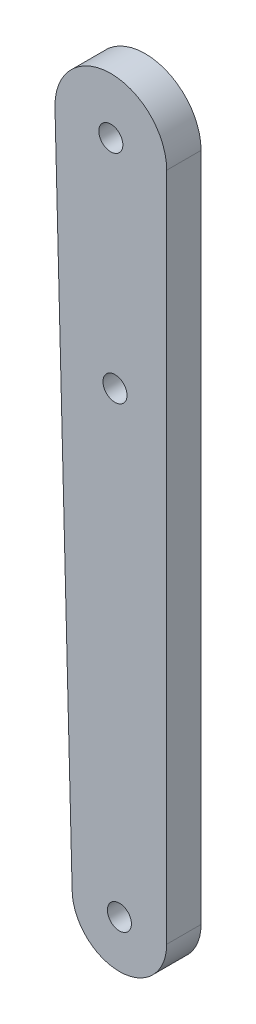
ISO-10303-21;
HEADER;
FILE_DESCRIPTION(('STEP AP214'),'2;1');
FILE_NAME('part.step','',(''),(''),'','','');
FILE_SCHEMA(('AUTOMOTIVE_DESIGN { 1 0 10303 214 1 1 1 1 }'));
ENDSEC;
DATA;
#1=APPLICATION_CONTEXT('core data for automotive mechanical design processes');
#2=APPLICATION_PROTOCOL_DEFINITION('international standard','automotive_design',2000,#1);
#3=PRODUCT_CONTEXT('',#1,'mechanical');
#4=PRODUCT('Part','Part','',(#3));
#5=PRODUCT_RELATED_PRODUCT_CATEGORY('part','',(#4));
#6=PRODUCT_DEFINITION_FORMATION('','',#4);
#7=PRODUCT_DEFINITION_CONTEXT('part definition',#1,'design');
#8=PRODUCT_DEFINITION('design','',#6,#7);
#9=PRODUCT_DEFINITION_SHAPE('','',#8);
#10=(LENGTH_UNIT() NAMED_UNIT(*) SI_UNIT(.MILLI.,.METRE.));
#11=(NAMED_UNIT(*) PLANE_ANGLE_UNIT() SI_UNIT($,.RADIAN.));
#12=(NAMED_UNIT(*) SI_UNIT($,.STERADIAN.) SOLID_ANGLE_UNIT());
#13=UNCERTAINTY_MEASURE_WITH_UNIT(LENGTH_MEASURE(1.E-05),#10,'distance_accuracy_value','');
#14=(GEOMETRIC_REPRESENTATION_CONTEXT(3) GLOBAL_UNCERTAINTY_ASSIGNED_CONTEXT((#13)) GLOBAL_UNIT_ASSIGNED_CONTEXT((#10,
#11,#12)) REPRESENTATION_CONTEXT('',''));
#15=CARTESIAN_POINT('',(0.,0.,0.));
#16=DIRECTION('',(0.,0.,1.));
#17=DIRECTION('',(1.,0.,0.));
#18=AXIS2_PLACEMENT_3D('',#15,#16,#17);
#19=CARTESIAN_POINT('',(-5.50068845938089,-12.9839082792742,4.));
#20=DIRECTION('',(0.,0.,1.));
#21=DIRECTION('',(1.,0.,0.));
#22=AXIS2_PLACEMENT_3D('',#19,#20,#21);
#23=PLANE('',#22);
#24=CARTESIAN_POINT('',(-5.50068845938089,-12.9839082792742,4.));
#25=DIRECTION('',(0.,0.,1.));
#26=DIRECTION('',(1.,0.,0.));
#27=AXIS2_PLACEMENT_3D('',#24,#25,#26);
#28=CIRCLE('',#27,1.4);
#29=CARTESIAN_POINT('',(-4.10068845938089,-12.9839082792742,4.));
#30=VERTEX_POINT('',#29);
#31=EDGE_CURVE('E118',#30,#30,#28,.T.);
#32=ORIENTED_EDGE('',*,*,#31,.F.);
#33=EDGE_LOOP('',(#32));
#34=FACE_BOUND('',#33,.T.);
#35=CARTESIAN_POINT('',(-5.50068845938089,-12.9839082792742,4.));
#36=DIRECTION('',(0.,0.,1.));
#37=DIRECTION('',(1.,0.,0.));
#38=AXIS2_PLACEMENT_3D('',#35,#36,#37);
#39=CIRCLE('',#38,5.5);
#40=CARTESIAN_POINT('',(-11.0006884593809,-12.9839082792742,4.));
#41=VERTEX_POINT('',#40);
#42=CARTESIAN_POINT('',(-0.000688459380887053,-12.9839082792742,4.));
#43=VERTEX_POINT('',#42);
#44=EDGE_CURVE('E88',#41,#43,#39,.T.);
#45=ORIENTED_EDGE('',*,*,#44,.T.);
#46=DIRECTION('',(0.,1.,0.));
#47=VECTOR('',#46,1.);
#48=CARTESIAN_POINT('',(-0.000688459380887053,-12.9839082792742,4.));
#49=LINE('',#48,#47);
#50=CARTESIAN_POINT('',(-0.000688459380887053,65.0160917207258,4.));
#51=VERTEX_POINT('',#50);
#52=EDGE_CURVE('E83',#43,#51,#49,.T.);
#53=ORIENTED_EDGE('',*,*,#52,.T.);
#54=CARTESIAN_POINT('',(-6.50068845938089,65.0160917207258,4.));
#55=DIRECTION('',(0.,0.,1.));
#56=DIRECTION('',(1.,0.,0.));
#57=AXIS2_PLACEMENT_3D('',#54,#55,#56);
#58=CIRCLE('',#57,6.5);
#59=CARTESIAN_POINT('',(-13.0006884593809,65.0160917207258,4.));
#60=VERTEX_POINT('',#59);
#61=EDGE_CURVE('E86',#51,#60,#58,.T.);
#62=ORIENTED_EDGE('',*,*,#61,.T.);
#63=DIRECTION('',(0.0256326007925508,-0.999671430909481,0.));
#64=VECTOR('',#63,1.);
#65=CARTESIAN_POINT('',(-13.0006884593809,65.0160917207258,4.));
#66=LINE('',#65,#64);
#67=EDGE_CURVE('E53',#60,#41,#66,.T.);
#68=ORIENTED_EDGE('',*,*,#67,.T.);
#69=EDGE_LOOP('',(#45,#53,#62,#68));
#70=FACE_BOUND('',#69,.T.);
#71=CARTESIAN_POINT('',(-6.50068845938089,65.0160917207258,4.));
#72=DIRECTION('',(0.,0.,1.));
#73=DIRECTION('',(1.,0.,0.));
#74=AXIS2_PLACEMENT_3D('',#71,#72,#73);
#75=CIRCLE('',#74,1.4);
#76=CARTESIAN_POINT('',(-5.10068845938089,65.0160917207258,4.));
#77=VERTEX_POINT('',#76);
#78=EDGE_CURVE('E103',#77,#77,#75,.T.);
#79=ORIENTED_EDGE('',*,*,#78,.F.);
#80=EDGE_LOOP('',(#79));
#81=FACE_BOUND('',#80,.T.);
#82=CARTESIAN_POINT('',(-6.01275635098238,40.0160917207258,4.));
#83=DIRECTION('',(0.,0.,1.));
#84=DIRECTION('',(1.,0.,0.));
#85=AXIS2_PLACEMENT_3D('',#82,#83,#84);
#86=CIRCLE('',#85,1.4);
#87=CARTESIAN_POINT('',(-4.61275635098238,40.0160917207258,4.));
#88=VERTEX_POINT('',#87);
#89=EDGE_CURVE('E124',#88,#88,#86,.T.);
#90=ORIENTED_EDGE('',*,*,#89,.F.);
#91=EDGE_LOOP('',(#90));
#92=FACE_BOUND('',#91,.T.);
#93=ADVANCED_FACE('F36',(#34,#70,#81,#92),#23,.T.);
#94=CARTESIAN_POINT('',(-5.50068845938089,-12.9839082792742,0.));
#95=DIRECTION('',(0.,0.,1.));
#96=DIRECTION('',(1.,0.,0.));
#97=AXIS2_PLACEMENT_3D('',#94,#95,#96);
#98=PLANE('',#97);
#99=CARTESIAN_POINT('',(-5.50068845938089,-12.9839082792742,0.));
#100=DIRECTION('',(0.,0.,1.));
#101=DIRECTION('',(1.,0.,0.));
#102=AXIS2_PLACEMENT_3D('',#99,#100,#101);
#103=CIRCLE('',#102,5.5);
#104=CARTESIAN_POINT('',(-11.0006884593809,-12.9839082792742,0.));
#105=VERTEX_POINT('',#104);
#106=CARTESIAN_POINT('',(-0.000688459380887053,-12.9839082792742,0.));
#107=VERTEX_POINT('',#106);
#108=EDGE_CURVE('E100',#105,#107,#103,.T.);
#109=ORIENTED_EDGE('',*,*,#108,.F.);
#110=DIRECTION('',(0.0256326007925508,-0.999671430909481,0.));
#111=VECTOR('',#110,1.);
#112=CARTESIAN_POINT('',(-13.0006884593809,65.0160917207258,0.));
#113=LINE('',#112,#111);
#114=CARTESIAN_POINT('',(-13.0006884593809,65.0160917207258,0.));
#115=VERTEX_POINT('',#114);
#116=EDGE_CURVE('E76',#115,#105,#113,.T.);
#117=ORIENTED_EDGE('',*,*,#116,.F.);
#118=CARTESIAN_POINT('',(-6.50068845938089,65.0160917207258,0.));
#119=DIRECTION('',(0.,0.,1.));
#120=DIRECTION('',(1.,0.,0.));
#121=AXIS2_PLACEMENT_3D('',#118,#119,#120);
#122=CIRCLE('',#121,6.5);
#123=CARTESIAN_POINT('',(-0.000688459380887053,65.0160917207258,0.));
#124=VERTEX_POINT('',#123);
#125=EDGE_CURVE('E70',#124,#115,#122,.T.);
#126=ORIENTED_EDGE('',*,*,#125,.F.);
#127=DIRECTION('',(0.,1.,0.));
#128=VECTOR('',#127,1.);
#129=CARTESIAN_POINT('',(-0.000688459380887053,-12.9839082792742,0.));
#130=LINE('',#129,#128);
#131=EDGE_CURVE('E92',#107,#124,#130,.T.);
#132=ORIENTED_EDGE('',*,*,#131,.F.);
#133=EDGE_LOOP('',(#109,#117,#126,#132));
#134=FACE_BOUND('',#133,.T.);
#135=CARTESIAN_POINT('',(-6.50068845938089,65.0160917207258,0.));
#136=DIRECTION('',(0.,0.,1.));
#137=DIRECTION('',(1.,0.,0.));
#138=AXIS2_PLACEMENT_3D('',#135,#136,#137);
#139=CIRCLE('',#138,1.4);
#140=CARTESIAN_POINT('',(-5.10068845938089,65.0160917207258,0.));
#141=VERTEX_POINT('',#140);
#142=EDGE_CURVE('E115',#141,#141,#139,.T.);
#143=ORIENTED_EDGE('',*,*,#142,.T.);
#144=EDGE_LOOP('',(#143));
#145=FACE_BOUND('',#144,.T.);
#146=CARTESIAN_POINT('',(-5.50068845938089,-12.9839082792742,0.));
#147=DIRECTION('',(0.,0.,1.));
#148=DIRECTION('',(1.,0.,0.));
#149=AXIS2_PLACEMENT_3D('',#146,#147,#148);
#150=CIRCLE('',#149,1.4);
#151=CARTESIAN_POINT('',(-4.10068845938089,-12.9839082792742,0.));
#152=VERTEX_POINT('',#151);
#153=EDGE_CURVE('E121',#152,#152,#150,.T.);
#154=ORIENTED_EDGE('',*,*,#153,.T.);
#155=EDGE_LOOP('',(#154));
#156=FACE_BOUND('',#155,.T.);
#157=CARTESIAN_POINT('',(-6.01275635098238,40.0160917207258,0.));
#158=DIRECTION('',(0.,0.,1.));
#159=DIRECTION('',(1.,0.,0.));
#160=AXIS2_PLACEMENT_3D('',#157,#158,#159);
#161=CIRCLE('',#160,1.4);
#162=CARTESIAN_POINT('',(-4.61275635098238,40.0160917207258,0.));
#163=VERTEX_POINT('',#162);
#164=EDGE_CURVE('E127',#163,#163,#161,.T.);
#165=ORIENTED_EDGE('',*,*,#164,.T.);
#166=EDGE_LOOP('',(#165));
#167=FACE_BOUND('',#166,.T.);
#168=ADVANCED_FACE('F111',(#134,#145,#156,#167),#98,.F.);
#169=CARTESIAN_POINT('',(-5.50068845938089,-12.9839082792742,4.));
#170=DIRECTION('',(0.,0.,-1.));
#171=DIRECTION('',(-1.,0.,0.));
#172=AXIS2_PLACEMENT_3D('',#169,#170,#171);
#173=CYLINDRICAL_SURFACE('',#172,5.5);
#174=ORIENTED_EDGE('',*,*,#108,.T.);
#175=DIRECTION('',(0.,0.,-1.));
#176=VECTOR('',#175,1.);
#177=CARTESIAN_POINT('',(-0.000688459380887053,-12.9839082792742,4.));
#178=LINE('',#177,#176);
#179=EDGE_CURVE('E11',#43,#107,#178,.T.);
#180=ORIENTED_EDGE('',*,*,#179,.F.);
#181=ORIENTED_EDGE('',*,*,#44,.F.);
#182=DIRECTION('',(0.,0.,-1.));
#183=VECTOR('',#182,1.);
#184=CARTESIAN_POINT('',(-11.0006884593809,-12.9839082792742,4.));
#185=LINE('',#184,#183);
#186=EDGE_CURVE('E96',#41,#105,#185,.T.);
#187=ORIENTED_EDGE('',*,*,#186,.T.);
#188=EDGE_LOOP('',(#174,#180,#181,#187));
#189=FACE_BOUND('',#188,.T.);
#190=ADVANCED_FACE('F38',(#189),#173,.T.);
#191=CARTESIAN_POINT('',(-0.000688459380887053,-12.9839082792742,4.));
#192=DIRECTION('',(-1.,0.,0.));
#193=DIRECTION('',(0.,0.,1.));
#194=AXIS2_PLACEMENT_3D('',#191,#192,#193);
#195=PLANE('',#194);
#196=ORIENTED_EDGE('',*,*,#131,.T.);
#197=DIRECTION('',(0.,0.,-1.));
#198=VECTOR('',#197,1.);
#199=CARTESIAN_POINT('',(-0.000688459380887053,65.0160917207258,4.));
#200=LINE('',#199,#198);
#201=EDGE_CURVE('E45',#51,#124,#200,.T.);
#202=ORIENTED_EDGE('',*,*,#201,.F.);
#203=ORIENTED_EDGE('',*,*,#52,.F.);
#204=ORIENTED_EDGE('',*,*,#179,.T.);
#205=EDGE_LOOP('',(#196,#202,#203,#204));
#206=FACE_BOUND('',#205,.T.);
#207=ADVANCED_FACE('F91',(#206),#195,.F.);
#208=CARTESIAN_POINT('',(-6.50068845938089,65.0160917207258,4.));
#209=DIRECTION('',(0.,0.,-1.));
#210=DIRECTION('',(-1.,0.,0.));
#211=AXIS2_PLACEMENT_3D('',#208,#209,#210);
#212=CYLINDRICAL_SURFACE('',#211,6.5);
#213=ORIENTED_EDGE('',*,*,#125,.T.);
#214=DIRECTION('',(0.,0.,-1.));
#215=VECTOR('',#214,1.);
#216=CARTESIAN_POINT('',(-13.0006884593809,65.0160917207258,4.));
#217=LINE('',#216,#215);
#218=EDGE_CURVE('E93',#60,#115,#217,.T.);
#219=ORIENTED_EDGE('',*,*,#218,.F.);
#220=ORIENTED_EDGE('',*,*,#61,.F.);
#221=ORIENTED_EDGE('',*,*,#201,.T.);
#222=EDGE_LOOP('',(#213,#219,#220,#221));
#223=FACE_BOUND('',#222,.T.);
#224=ADVANCED_FACE('F94',(#223),#212,.T.);
#225=CARTESIAN_POINT('',(-13.0006884593809,65.0160917207258,4.));
#226=DIRECTION('',(0.999671430909481,0.0256326007925508,0.));
#227=DIRECTION('',(-0.0256326007925508,0.999671430909481,0.));
#228=AXIS2_PLACEMENT_3D('',#225,#226,#227);
#229=PLANE('',#228);
#230=ORIENTED_EDGE('',*,*,#116,.T.);
#231=ORIENTED_EDGE('',*,*,#186,.F.);
#232=ORIENTED_EDGE('',*,*,#67,.F.);
#233=ORIENTED_EDGE('',*,*,#218,.T.);
#234=EDGE_LOOP('',(#230,#231,#232,#233));
#235=FACE_BOUND('',#234,.T.);
#236=ADVANCED_FACE('F108',(#235),#229,.F.);
#237=CARTESIAN_POINT('',(-6.50068845938089,65.0160917207258,4.));
#238=DIRECTION('',(0.,0.,-1.));
#239=DIRECTION('',(-1.,0.,0.));
#240=AXIS2_PLACEMENT_3D('',#237,#238,#239);
#241=CYLINDRICAL_SURFACE('',#240,1.4);
#242=ORIENTED_EDGE('',*,*,#78,.T.);
#243=EDGE_LOOP('',(#242));
#244=FACE_BOUND('',#243,.T.);
#245=ORIENTED_EDGE('',*,*,#142,.F.);
#246=EDGE_LOOP('',(#245));
#247=FACE_BOUND('',#246,.T.);
#248=ADVANCED_FACE('F145',(#244,#247),#241,.F.);
#249=CARTESIAN_POINT('',(-5.50068845938089,-12.9839082792742,4.));
#250=DIRECTION('',(0.,0.,-1.));
#251=DIRECTION('',(-1.,0.,0.));
#252=AXIS2_PLACEMENT_3D('',#249,#250,#251);
#253=CYLINDRICAL_SURFACE('',#252,1.4);
#254=ORIENTED_EDGE('',*,*,#31,.T.);
#255=EDGE_LOOP('',(#254));
#256=FACE_BOUND('',#255,.T.);
#257=ORIENTED_EDGE('',*,*,#153,.F.);
#258=EDGE_LOOP('',(#257));
#259=FACE_BOUND('',#258,.T.);
#260=ADVANCED_FACE('F191',(#256,#259),#253,.F.);
#261=CARTESIAN_POINT('',(-6.01275635098238,40.0160917207258,4.));
#262=DIRECTION('',(0.,0.,-1.));
#263=DIRECTION('',(-1.,0.,0.));
#264=AXIS2_PLACEMENT_3D('',#261,#262,#263);
#265=CYLINDRICAL_SURFACE('',#264,1.4);
#266=ORIENTED_EDGE('',*,*,#89,.T.);
#267=EDGE_LOOP('',(#266));
#268=FACE_BOUND('',#267,.T.);
#269=ORIENTED_EDGE('',*,*,#164,.F.);
#270=EDGE_LOOP('',(#269));
#271=FACE_BOUND('',#270,.T.);
#272=ADVANCED_FACE('F133',(#268,#271),#265,.F.);
#273=CLOSED_SHELL('',(#93,#168,#190,#207,#224,#236,#248,#260,#272));
#274=MANIFOLD_SOLID_BREP('B2',#273);
#275=ADVANCED_BREP_SHAPE_REPRESENTATION('',(#18,#274),#14);
#276=SHAPE_DEFINITION_REPRESENTATION(#9,#275);
ENDSEC;
END-ISO-10303-21;
